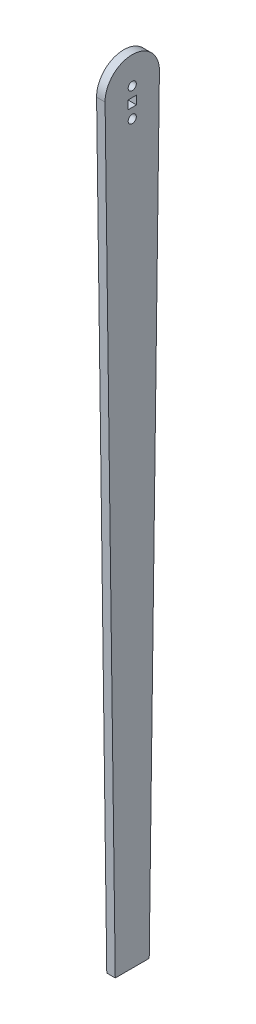
ISO-10303-21;
HEADER;
FILE_DESCRIPTION(('STEP AP214'),'2;1');
FILE_NAME('part.step','',(''),(''),'','','');
FILE_SCHEMA(('AUTOMOTIVE_DESIGN { 1 0 10303 214 1 1 1 1 }'));
ENDSEC;
DATA;
#1=APPLICATION_CONTEXT('core data for automotive mechanical design processes');
#2=APPLICATION_PROTOCOL_DEFINITION('international standard','automotive_design',2000,#1);
#3=PRODUCT_CONTEXT('',#1,'mechanical');
#4=PRODUCT('Part','Part','',(#3));
#5=PRODUCT_RELATED_PRODUCT_CATEGORY('part','',(#4));
#6=PRODUCT_DEFINITION_FORMATION('','',#4);
#7=PRODUCT_DEFINITION_CONTEXT('part definition',#1,'design');
#8=PRODUCT_DEFINITION('design','',#6,#7);
#9=PRODUCT_DEFINITION_SHAPE('','',#8);
#10=(LENGTH_UNIT() NAMED_UNIT(*) SI_UNIT(.MILLI.,.METRE.));
#11=(NAMED_UNIT(*) PLANE_ANGLE_UNIT() SI_UNIT($,.RADIAN.));
#12=(NAMED_UNIT(*) SI_UNIT($,.STERADIAN.) SOLID_ANGLE_UNIT());
#13=UNCERTAINTY_MEASURE_WITH_UNIT(LENGTH_MEASURE(1.E-05),#10,'distance_accuracy_value','');
#14=(GEOMETRIC_REPRESENTATION_CONTEXT(3) GLOBAL_UNCERTAINTY_ASSIGNED_CONTEXT((#13)) GLOBAL_UNIT_ASSIGNED_CONTEXT((#10,
#11,#12)) REPRESENTATION_CONTEXT('',''));
#15=CARTESIAN_POINT('',(0.,0.,0.));
#16=DIRECTION('',(0.,0.,1.));
#17=DIRECTION('',(1.,0.,0.));
#18=AXIS2_PLACEMENT_3D('',#15,#16,#17);
#19=CARTESIAN_POINT('',(3.175,0.,0.));
#20=DIRECTION('',(-1.,0.,0.));
#21=DIRECTION('',(0.,0.,1.));
#22=AXIS2_PLACEMENT_3D('',#19,#20,#21);
#23=PLANE('',#22);
#24=CARTESIAN_POINT('',(3.175,0.,0.));
#25=DIRECTION('',(1.,0.,0.));
#26=DIRECTION('',(0.,0.,-1.));
#27=AXIS2_PLACEMENT_3D('',#24,#25,#26);
#28=CIRCLE('',#27,1.524);
#29=CARTESIAN_POINT('',(3.175,0.,-1.524));
#30=VERTEX_POINT('',#29);
#31=EDGE_CURVE('E124',#30,#30,#28,.T.);
#32=ORIENTED_EDGE('',*,*,#31,.F.);
#33=EDGE_LOOP('',(#32));
#34=FACE_BOUND('',#33,.T.);
#35=DIRECTION('',(0.,-0.999911080809421,-0.0133353093153462));
#36=VECTOR('',#35,1.);
#37=CARTESIAN_POINT('',(3.175,-285.75,6.35));
#38=LINE('',#37,#36);
#39=CARTESIAN_POINT('',(3.175,-0.135486742643922,10.1590965810237));
#40=VERTEX_POINT('',#39);
#41=CARTESIAN_POINT('',(3.175,-285.75,6.35));
#42=VERTEX_POINT('',#41);
#43=EDGE_CURVE('E134',#40,#42,#38,.T.);
#44=ORIENTED_EDGE('',*,*,#43,.T.);
#45=DIRECTION('',(0.,0.,-1.));
#46=VECTOR('',#45,1.);
#47=CARTESIAN_POINT('',(3.175,-285.75,6.35));
#48=LINE('',#47,#46);
#49=CARTESIAN_POINT('',(3.175,-285.75,-6.35));
#50=VERTEX_POINT('',#49);
#51=EDGE_CURVE('E137',#42,#50,#48,.T.);
#52=ORIENTED_EDGE('',*,*,#51,.T.);
#53=DIRECTION('',(0.,0.999911080809421,-0.0133353093153462));
#54=VECTOR('',#53,1.);
#55=CARTESIAN_POINT('',(3.175,-285.75,-6.35));
#56=LINE('',#55,#54);
#57=CARTESIAN_POINT('',(3.175,-0.135486742643917,-10.1590965810237));
#58=VERTEX_POINT('',#57);
#59=EDGE_CURVE('E140',#50,#58,#56,.T.);
#60=ORIENTED_EDGE('',*,*,#59,.T.);
#61=CARTESIAN_POINT('',(3.175,0.,0.));
#62=DIRECTION('',(1.,0.,0.));
#63=DIRECTION('',(0.,0.,1.));
#64=AXIS2_PLACEMENT_3D('',#61,#62,#63);
#65=CIRCLE('',#64,10.16);
#66=EDGE_CURVE('E142',#58,#40,#65,.T.);
#67=ORIENTED_EDGE('',*,*,#66,.T.);
#68=EDGE_LOOP('',(#44,#52,#60,#67));
#69=FACE_BOUND('',#68,.T.);
#70=DIRECTION('',(0.,-1.,0.));
#71=VECTOR('',#70,1.);
#72=CARTESIAN_POINT('',(3.175,-3.7465,1.5875));
#73=LINE('',#72,#71);
#74=CARTESIAN_POINT('',(3.175,-3.7465,1.5875));
#75=VERTEX_POINT('',#74);
#76=CARTESIAN_POINT('',(3.175,-6.9215,1.5875));
#77=VERTEX_POINT('',#76);
#78=EDGE_CURVE('E95',#75,#77,#73,.T.);
#79=ORIENTED_EDGE('',*,*,#78,.F.);
#80=DIRECTION('',(0.,0.,1.));
#81=VECTOR('',#80,1.);
#82=CARTESIAN_POINT('',(3.175,-3.7465,1.5875));
#83=LINE('',#82,#81);
#84=CARTESIAN_POINT('',(3.175,-3.7465,-1.5875));
#85=VERTEX_POINT('',#84);
#86=EDGE_CURVE('E118',#85,#75,#83,.T.);
#87=ORIENTED_EDGE('',*,*,#86,.F.);
#88=DIRECTION('',(0.,1.,0.));
#89=VECTOR('',#88,1.);
#90=CARTESIAN_POINT('',(3.175,-3.7465,-1.5875));
#91=LINE('',#90,#89);
#92=CARTESIAN_POINT('',(3.175,-6.9215,-1.5875));
#93=VERTEX_POINT('',#92);
#94=EDGE_CURVE('E116',#93,#85,#91,.T.);
#95=ORIENTED_EDGE('',*,*,#94,.F.);
#96=DIRECTION('',(0.,0.,-1.));
#97=VECTOR('',#96,1.);
#98=CARTESIAN_POINT('',(3.175,-6.9215,1.5875));
#99=LINE('',#98,#97);
#100=EDGE_CURVE('E103',#77,#93,#99,.T.);
#101=ORIENTED_EDGE('',*,*,#100,.F.);
#102=EDGE_LOOP('',(#79,#87,#95,#101));
#103=FACE_BOUND('',#102,.T.);
#104=CARTESIAN_POINT('',(3.175,-10.668,0.));
#105=DIRECTION('',(1.,0.,0.));
#106=DIRECTION('',(0.,0.,-1.));
#107=AXIS2_PLACEMENT_3D('',#104,#105,#106);
#108=CIRCLE('',#107,1.524);
#109=CARTESIAN_POINT('',(3.175,-10.668,-1.524));
#110=VERTEX_POINT('',#109);
#111=EDGE_CURVE('E225',#110,#110,#108,.T.);
#112=ORIENTED_EDGE('',*,*,#111,.F.);
#113=EDGE_LOOP('',(#112));
#114=FACE_BOUND('',#113,.T.);
#115=ADVANCED_FACE('F30',(#34,#69,#103,#114),#23,.F.);
#116=CARTESIAN_POINT('',(0.,0.,0.));
#117=DIRECTION('',(-1.,0.,0.));
#118=DIRECTION('',(0.,0.,1.));
#119=AXIS2_PLACEMENT_3D('',#116,#117,#118);
#120=PLANE('',#119);
#121=CARTESIAN_POINT('',(0.,0.,0.));
#122=DIRECTION('',(1.,0.,0.));
#123=DIRECTION('',(0.,0.,-1.));
#124=AXIS2_PLACEMENT_3D('',#121,#122,#123);
#125=CIRCLE('',#124,1.524);
#126=CARTESIAN_POINT('',(0.,0.,-1.524));
#127=VERTEX_POINT('',#126);
#128=EDGE_CURVE('E231',#127,#127,#125,.T.);
#129=ORIENTED_EDGE('',*,*,#128,.T.);
#130=EDGE_LOOP('',(#129));
#131=FACE_BOUND('',#130,.T.);
#132=DIRECTION('',(0.,-0.999911080809421,-0.0133353093153462));
#133=VECTOR('',#132,1.);
#134=CARTESIAN_POINT('',(0.,-285.75,6.35));
#135=LINE('',#134,#133);
#136=CARTESIAN_POINT('',(0.,-0.135486742643922,10.1590965810237));
#137=VERTEX_POINT('',#136);
#138=CARTESIAN_POINT('',(0.,-285.75,6.35));
#139=VERTEX_POINT('',#138);
#140=EDGE_CURVE('E111',#137,#139,#135,.T.);
#141=ORIENTED_EDGE('',*,*,#140,.F.);
#142=CARTESIAN_POINT('',(0.,0.,0.));
#143=DIRECTION('',(1.,0.,0.));
#144=DIRECTION('',(0.,0.,1.));
#145=AXIS2_PLACEMENT_3D('',#142,#143,#144);
#146=CIRCLE('',#145,10.16);
#147=CARTESIAN_POINT('',(0.,-0.135486742643917,-10.1590965810237));
#148=VERTEX_POINT('',#147);
#149=EDGE_CURVE('E138',#148,#137,#146,.T.);
#150=ORIENTED_EDGE('',*,*,#149,.F.);
#151=DIRECTION('',(0.,0.999911080809421,-0.0133353093153462));
#152=VECTOR('',#151,1.);
#153=CARTESIAN_POINT('',(0.,-285.75,-6.35));
#154=LINE('',#153,#152);
#155=CARTESIAN_POINT('',(0.,-285.75,-6.35));
#156=VERTEX_POINT('',#155);
#157=EDGE_CURVE('E149',#156,#148,#154,.T.);
#158=ORIENTED_EDGE('',*,*,#157,.F.);
#159=DIRECTION('',(0.,0.,-1.));
#160=VECTOR('',#159,1.);
#161=CARTESIAN_POINT('',(0.,-285.75,6.35));
#162=LINE('',#161,#160);
#163=EDGE_CURVE('E147',#139,#156,#162,.T.);
#164=ORIENTED_EDGE('',*,*,#163,.F.);
#165=EDGE_LOOP('',(#141,#150,#158,#164));
#166=FACE_BOUND('',#165,.T.);
#167=DIRECTION('',(0.,0.,1.));
#168=VECTOR('',#167,1.);
#169=CARTESIAN_POINT('',(0.,-3.7465,1.5875));
#170=LINE('',#169,#168);
#171=CARTESIAN_POINT('',(0.,-3.7465,-1.5875));
#172=VERTEX_POINT('',#171);
#173=CARTESIAN_POINT('',(0.,-3.7465,1.5875));
#174=VERTEX_POINT('',#173);
#175=EDGE_CURVE('E104',#172,#174,#170,.T.);
#176=ORIENTED_EDGE('',*,*,#175,.T.);
#177=DIRECTION('',(0.,-1.,0.));
#178=VECTOR('',#177,1.);
#179=CARTESIAN_POINT('',(0.,-3.7465,1.5875));
#180=LINE('',#179,#178);
#181=CARTESIAN_POINT('',(0.,-6.9215,1.5875));
#182=VERTEX_POINT('',#181);
#183=EDGE_CURVE('E53',#174,#182,#180,.T.);
#184=ORIENTED_EDGE('',*,*,#183,.T.);
#185=DIRECTION('',(0.,0.,-1.));
#186=VECTOR('',#185,1.);
#187=CARTESIAN_POINT('',(0.,-6.9215,1.5875));
#188=LINE('',#187,#186);
#189=CARTESIAN_POINT('',(0.,-6.9215,-1.5875));
#190=VERTEX_POINT('',#189);
#191=EDGE_CURVE('E110',#182,#190,#188,.T.);
#192=ORIENTED_EDGE('',*,*,#191,.T.);
#193=DIRECTION('',(0.,1.,0.));
#194=VECTOR('',#193,1.);
#195=CARTESIAN_POINT('',(0.,-3.7465,-1.5875));
#196=LINE('',#195,#194);
#197=EDGE_CURVE('E126',#190,#172,#196,.T.);
#198=ORIENTED_EDGE('',*,*,#197,.T.);
#199=EDGE_LOOP('',(#176,#184,#192,#198));
#200=FACE_BOUND('',#199,.T.);
#201=CARTESIAN_POINT('',(0.,-10.668,0.));
#202=DIRECTION('',(1.,0.,0.));
#203=DIRECTION('',(0.,0.,-1.));
#204=AXIS2_PLACEMENT_3D('',#201,#202,#203);
#205=CIRCLE('',#204,1.524);
#206=CARTESIAN_POINT('',(0.,-10.668,-1.524));
#207=VERTEX_POINT('',#206);
#208=EDGE_CURVE('E228',#207,#207,#205,.T.);
#209=ORIENTED_EDGE('',*,*,#208,.T.);
#210=EDGE_LOOP('',(#209));
#211=FACE_BOUND('',#210,.T.);
#212=ADVANCED_FACE('F167',(#131,#166,#200,#211),#120,.T.);
#213=CARTESIAN_POINT('',(3.175,-285.75,6.35));
#214=DIRECTION('',(0.,0.0133353093153462,-0.999911080809421));
#215=DIRECTION('',(0.,0.999911080809421,0.0133353093153462));
#216=AXIS2_PLACEMENT_3D('',#213,#214,#215);
#217=PLANE('',#216);
#218=ORIENTED_EDGE('',*,*,#140,.T.);
#219=DIRECTION('',(-1.,0.,0.));
#220=VECTOR('',#219,1.);
#221=CARTESIAN_POINT('',(3.175,-285.75,6.35));
#222=LINE('',#221,#220);
#223=EDGE_CURVE('E11',#42,#139,#222,.T.);
#224=ORIENTED_EDGE('',*,*,#223,.F.);
#225=ORIENTED_EDGE('',*,*,#43,.F.);
#226=DIRECTION('',(-1.,0.,0.));
#227=VECTOR('',#226,1.);
#228=CARTESIAN_POINT('',(3.175,-0.135486742643922,10.1590965810237));
#229=LINE('',#228,#227);
#230=EDGE_CURVE('E144',#40,#137,#229,.T.);
#231=ORIENTED_EDGE('',*,*,#230,.T.);
#232=EDGE_LOOP('',(#218,#224,#225,#231));
#233=FACE_BOUND('',#232,.T.);
#234=ADVANCED_FACE('F32',(#233),#217,.F.);
#235=CARTESIAN_POINT('',(3.175,-285.75,6.35));
#236=DIRECTION('',(0.,1.,0.));
#237=DIRECTION('',(0.,0.,1.));
#238=AXIS2_PLACEMENT_3D('',#235,#236,#237);
#239=PLANE('',#238);
#240=ORIENTED_EDGE('',*,*,#163,.T.);
#241=DIRECTION('',(-1.,0.,0.));
#242=VECTOR('',#241,1.);
#243=CARTESIAN_POINT('',(3.175,-285.75,-6.35));
#244=LINE('',#243,#242);
#245=EDGE_CURVE('E38',#50,#156,#244,.T.);
#246=ORIENTED_EDGE('',*,*,#245,.F.);
#247=ORIENTED_EDGE('',*,*,#51,.F.);
#248=ORIENTED_EDGE('',*,*,#223,.T.);
#249=EDGE_LOOP('',(#240,#246,#247,#248));
#250=FACE_BOUND('',#249,.T.);
#251=ADVANCED_FACE('F177',(#250),#239,.F.);
#252=CARTESIAN_POINT('',(3.175,-285.75,-6.35));
#253=DIRECTION('',(0.,0.0133353093153462,0.999911080809421));
#254=DIRECTION('',(0.,-0.999911080809421,0.0133353093153462));
#255=AXIS2_PLACEMENT_3D('',#252,#253,#254);
#256=PLANE('',#255);
#257=ORIENTED_EDGE('',*,*,#157,.T.);
#258=DIRECTION('',(-1.,0.,0.));
#259=VECTOR('',#258,1.);
#260=CARTESIAN_POINT('',(3.175,-0.135486742643917,-10.1590965810237));
#261=LINE('',#260,#259);
#262=EDGE_CURVE('E154',#58,#148,#261,.T.);
#263=ORIENTED_EDGE('',*,*,#262,.F.);
#264=ORIENTED_EDGE('',*,*,#59,.F.);
#265=ORIENTED_EDGE('',*,*,#245,.T.);
#266=EDGE_LOOP('',(#257,#263,#264,#265));
#267=FACE_BOUND('',#266,.T.);
#268=ADVANCED_FACE('F161',(#267),#256,.F.);
#269=CARTESIAN_POINT('',(3.175,0.,0.));
#270=DIRECTION('',(-1.,0.,0.));
#271=DIRECTION('',(0.,0.,1.));
#272=AXIS2_PLACEMENT_3D('',#269,#270,#271);
#273=CYLINDRICAL_SURFACE('',#272,10.16);
#274=ORIENTED_EDGE('',*,*,#149,.T.);
#275=ORIENTED_EDGE('',*,*,#230,.F.);
#276=ORIENTED_EDGE('',*,*,#66,.F.);
#277=ORIENTED_EDGE('',*,*,#262,.T.);
#278=EDGE_LOOP('',(#274,#275,#276,#277));
#279=FACE_BOUND('',#278,.T.);
#280=ADVANCED_FACE('F171',(#279),#273,.T.);
#281=CARTESIAN_POINT('',(3.175,-3.7465,1.5875));
#282=DIRECTION('',(0.,0.,-1.));
#283=DIRECTION('',(0.,1.,0.));
#284=AXIS2_PLACEMENT_3D('',#281,#282,#283);
#285=PLANE('',#284);
#286=ORIENTED_EDGE('',*,*,#183,.F.);
#287=DIRECTION('',(-1.,0.,0.));
#288=VECTOR('',#287,1.);
#289=CARTESIAN_POINT('',(3.175,-3.7465,1.5875));
#290=LINE('',#289,#288);
#291=EDGE_CURVE('E99',#75,#174,#290,.T.);
#292=ORIENTED_EDGE('',*,*,#291,.F.);
#293=ORIENTED_EDGE('',*,*,#78,.T.);
#294=DIRECTION('',(-1.,0.,0.));
#295=VECTOR('',#294,1.);
#296=CARTESIAN_POINT('',(3.175,-6.9215,1.5875));
#297=LINE('',#296,#295);
#298=EDGE_CURVE('E98',#77,#182,#297,.T.);
#299=ORIENTED_EDGE('',*,*,#298,.T.);
#300=EDGE_LOOP('',(#286,#292,#293,#299));
#301=FACE_BOUND('',#300,.T.);
#302=ADVANCED_FACE('F97',(#301),#285,.T.);
#303=CARTESIAN_POINT('',(3.175,-6.9215,1.5875));
#304=DIRECTION('',(0.,1.,0.));
#305=DIRECTION('',(0.,0.,1.));
#306=AXIS2_PLACEMENT_3D('',#303,#304,#305);
#307=PLANE('',#306);
#308=ORIENTED_EDGE('',*,*,#191,.F.);
#309=ORIENTED_EDGE('',*,*,#298,.F.);
#310=ORIENTED_EDGE('',*,*,#100,.T.);
#311=DIRECTION('',(-1.,0.,0.));
#312=VECTOR('',#311,1.);
#313=CARTESIAN_POINT('',(3.175,-6.9215,-1.5875));
#314=LINE('',#313,#312);
#315=EDGE_CURVE('E112',#93,#190,#314,.T.);
#316=ORIENTED_EDGE('',*,*,#315,.T.);
#317=EDGE_LOOP('',(#308,#309,#310,#316));
#318=FACE_BOUND('',#317,.T.);
#319=ADVANCED_FACE('F107',(#318),#307,.T.);
#320=CARTESIAN_POINT('',(3.175,-3.7465,-1.5875));
#321=DIRECTION('',(0.,0.,1.));
#322=DIRECTION('',(0.,-1.,0.));
#323=AXIS2_PLACEMENT_3D('',#320,#321,#322);
#324=PLANE('',#323);
#325=ORIENTED_EDGE('',*,*,#197,.F.);
#326=ORIENTED_EDGE('',*,*,#315,.F.);
#327=ORIENTED_EDGE('',*,*,#94,.T.);
#328=DIRECTION('',(-1.,0.,0.));
#329=VECTOR('',#328,1.);
#330=CARTESIAN_POINT('',(3.175,-3.7465,-1.5875));
#331=LINE('',#330,#329);
#332=EDGE_CURVE('E45',#85,#172,#331,.T.);
#333=ORIENTED_EDGE('',*,*,#332,.T.);
#334=EDGE_LOOP('',(#325,#326,#327,#333));
#335=FACE_BOUND('',#334,.T.);
#336=ADVANCED_FACE('F203',(#335),#324,.T.);
#337=CARTESIAN_POINT('',(3.175,-3.7465,1.5875));
#338=DIRECTION('',(0.,-1.,0.));
#339=DIRECTION('',(0.,0.,-1.));
#340=AXIS2_PLACEMENT_3D('',#337,#338,#339);
#341=PLANE('',#340);
#342=ORIENTED_EDGE('',*,*,#175,.F.);
#343=ORIENTED_EDGE('',*,*,#332,.F.);
#344=ORIENTED_EDGE('',*,*,#86,.T.);
#345=ORIENTED_EDGE('',*,*,#291,.T.);
#346=EDGE_LOOP('',(#342,#343,#344,#345));
#347=FACE_BOUND('',#346,.T.);
#348=ADVANCED_FACE('F207',(#347),#341,.T.);
#349=CARTESIAN_POINT('',(3.175,0.,0.));
#350=DIRECTION('',(-1.,0.,0.));
#351=DIRECTION('',(0.,0.,1.));
#352=AXIS2_PLACEMENT_3D('',#349,#350,#351);
#353=CYLINDRICAL_SURFACE('',#352,1.524);
#354=ORIENTED_EDGE('',*,*,#31,.T.);
#355=EDGE_LOOP('',(#354));
#356=FACE_BOUND('',#355,.T.);
#357=ORIENTED_EDGE('',*,*,#128,.F.);
#358=EDGE_LOOP('',(#357));
#359=FACE_BOUND('',#358,.T.);
#360=ADVANCED_FACE('F213',(#356,#359),#353,.F.);
#361=CARTESIAN_POINT('',(3.175,-10.668,0.));
#362=DIRECTION('',(-1.,0.,0.));
#363=DIRECTION('',(0.,0.,1.));
#364=AXIS2_PLACEMENT_3D('',#361,#362,#363);
#365=CYLINDRICAL_SURFACE('',#364,1.524);
#366=ORIENTED_EDGE('',*,*,#111,.T.);
#367=EDGE_LOOP('',(#366));
#368=FACE_BOUND('',#367,.T.);
#369=ORIENTED_EDGE('',*,*,#208,.F.);
#370=EDGE_LOOP('',(#369));
#371=FACE_BOUND('',#370,.T.);
#372=ADVANCED_FACE('F216',(#368,#371),#365,.F.);
#373=CLOSED_SHELL('',(#115,#212,#234,#251,#268,#280,#302,#319,#336,#348,#360,#372));
#374=MANIFOLD_SOLID_BREP('B2',#373);
#375=ADVANCED_BREP_SHAPE_REPRESENTATION('',(#18,#374),#14);
#376=SHAPE_DEFINITION_REPRESENTATION(#9,#375);
ENDSEC;
END-ISO-10303-21;
